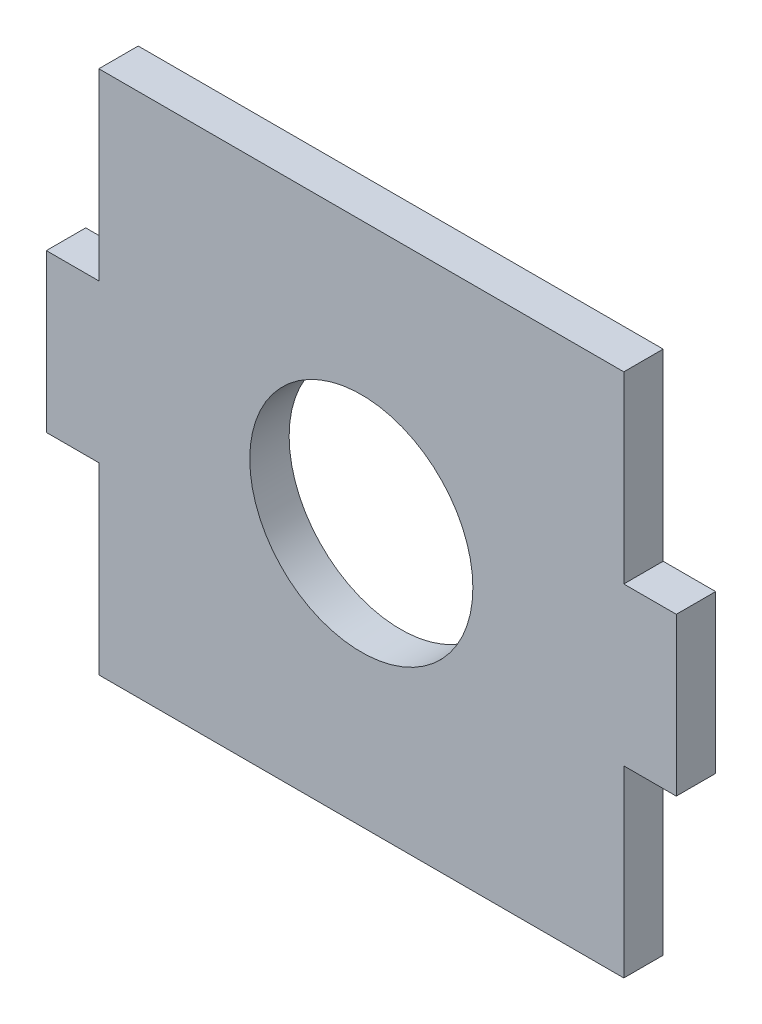
ISO-10303-21;
HEADER;
FILE_DESCRIPTION(('STEP AP214'),'2;1');
FILE_NAME('part.step','',(''),(''),'','','');
FILE_SCHEMA(('AUTOMOTIVE_DESIGN { 1 0 10303 214 1 1 1 1 }'));
ENDSEC;
DATA;
#1=APPLICATION_CONTEXT('core data for automotive mechanical design processes');
#2=APPLICATION_PROTOCOL_DEFINITION('international standard','automotive_design',2000,#1);
#3=PRODUCT_CONTEXT('',#1,'mechanical');
#4=PRODUCT('Part','Part','',(#3));
#5=PRODUCT_RELATED_PRODUCT_CATEGORY('part','',(#4));
#6=PRODUCT_DEFINITION_FORMATION('','',#4);
#7=PRODUCT_DEFINITION_CONTEXT('part definition',#1,'design');
#8=PRODUCT_DEFINITION('design','',#6,#7);
#9=PRODUCT_DEFINITION_SHAPE('','',#8);
#10=(LENGTH_UNIT() NAMED_UNIT(*) SI_UNIT(.MILLI.,.METRE.));
#11=(NAMED_UNIT(*) PLANE_ANGLE_UNIT() SI_UNIT($,.RADIAN.));
#12=(NAMED_UNIT(*) SI_UNIT($,.STERADIAN.) SOLID_ANGLE_UNIT());
#13=UNCERTAINTY_MEASURE_WITH_UNIT(LENGTH_MEASURE(1.E-05),#10,'distance_accuracy_value','');
#14=(GEOMETRIC_REPRESENTATION_CONTEXT(3) GLOBAL_UNCERTAINTY_ASSIGNED_CONTEXT((#13)) GLOBAL_UNIT_ASSIGNED_CONTEXT((#10,
#11,#12)) REPRESENTATION_CONTEXT('',''));
#15=CARTESIAN_POINT('',(0.,0.,0.));
#16=DIRECTION('',(0.,0.,1.));
#17=DIRECTION('',(1.,0.,0.));
#18=AXIS2_PLACEMENT_3D('',#15,#16,#17);
#19=CARTESIAN_POINT('',(0.,0.,4.7625));
#20=DIRECTION('',(0.,1.,0.));
#21=DIRECTION('',(0.,0.,1.));
#22=AXIS2_PLACEMENT_3D('',#19,#20,#21);
#23=PLANE('',#22);
#24=DIRECTION('',(1.,0.,0.));
#25=VECTOR('',#24,1.);
#26=CARTESIAN_POINT('',(0.,0.,0.));
#27=LINE('',#26,#25);
#28=CARTESIAN_POINT('',(0.,0.,0.));
#29=VERTEX_POINT('',#28);
#30=CARTESIAN_POINT('',(63.5,0.,0.));
#31=VERTEX_POINT('',#30);
#32=EDGE_CURVE('E164',#29,#31,#27,.T.);
#33=ORIENTED_EDGE('',*,*,#32,.T.);
#34=DIRECTION('',(0.,0.,-1.));
#35=VECTOR('',#34,1.);
#36=CARTESIAN_POINT('',(63.5,0.,4.7625));
#37=LINE('',#36,#35);
#38=CARTESIAN_POINT('',(63.5,0.,4.7625));
#39=VERTEX_POINT('',#38);
#40=EDGE_CURVE('E11',#39,#31,#37,.T.);
#41=ORIENTED_EDGE('',*,*,#40,.F.);
#42=DIRECTION('',(1.,0.,0.));
#43=VECTOR('',#42,1.);
#44=CARTESIAN_POINT('',(0.,0.,4.7625));
#45=LINE('',#44,#43);
#46=CARTESIAN_POINT('',(0.,0.,4.7625));
#47=VERTEX_POINT('',#46);
#48=EDGE_CURVE('E356',#47,#39,#45,.T.);
#49=ORIENTED_EDGE('',*,*,#48,.F.);
#50=DIRECTION('',(0.,0.,-1.));
#51=VECTOR('',#50,1.);
#52=CARTESIAN_POINT('',(0.,0.,4.7625));
#53=LINE('',#52,#51);
#54=EDGE_CURVE('E54',#47,#29,#53,.T.);
#55=ORIENTED_EDGE('',*,*,#54,.T.);
#56=EDGE_LOOP('',(#33,#41,#49,#55));
#57=FACE_BOUND('',#56,.T.);
#58=ADVANCED_FACE('F37',(#57),#23,.F.);
#59=CARTESIAN_POINT('',(63.5,0.,4.7625));
#60=DIRECTION('',(-1.,0.,0.));
#61=DIRECTION('',(0.,0.,1.));
#62=AXIS2_PLACEMENT_3D('',#59,#60,#61);
#63=PLANE('',#62);
#64=DIRECTION('',(0.,1.,0.));
#65=VECTOR('',#64,1.);
#66=CARTESIAN_POINT('',(63.5,0.,0.));
#67=LINE('',#66,#65);
#68=CARTESIAN_POINT('',(63.5,22.225,0.));
#69=VERTEX_POINT('',#68);
#70=EDGE_CURVE('E166',#31,#69,#67,.T.);
#71=ORIENTED_EDGE('',*,*,#70,.T.);
#72=DIRECTION('',(0.,0.,-1.));
#73=VECTOR('',#72,1.);
#74=CARTESIAN_POINT('',(63.5,22.225,4.7625));
#75=LINE('',#74,#73);
#76=CARTESIAN_POINT('',(63.5,22.225,4.7625));
#77=VERTEX_POINT('',#76);
#78=EDGE_CURVE('E46',#77,#69,#75,.T.);
#79=ORIENTED_EDGE('',*,*,#78,.F.);
#80=DIRECTION('',(0.,1.,0.));
#81=VECTOR('',#80,1.);
#82=CARTESIAN_POINT('',(63.5,0.,4.7625));
#83=LINE('',#82,#81);
#84=EDGE_CURVE('E104',#39,#77,#83,.T.);
#85=ORIENTED_EDGE('',*,*,#84,.F.);
#86=ORIENTED_EDGE('',*,*,#40,.T.);
#87=EDGE_LOOP('',(#71,#79,#85,#86));
#88=FACE_BOUND('',#87,.T.);
#89=ADVANCED_FACE('F257',(#88),#63,.F.);
#90=CARTESIAN_POINT('',(0.,22.225,4.7625));
#91=DIRECTION('',(0.,1.,0.));
#92=DIRECTION('',(0.,0.,1.));
#93=AXIS2_PLACEMENT_3D('',#90,#91,#92);
#94=PLANE('',#93);
#95=DIRECTION('',(1.,0.,0.));
#96=VECTOR('',#95,1.);
#97=CARTESIAN_POINT('',(0.,22.225,0.));
#98=LINE('',#97,#96);
#99=CARTESIAN_POINT('',(69.85,22.225,0.));
#100=VERTEX_POINT('',#99);
#101=EDGE_CURVE('E168',#69,#100,#98,.T.);
#102=ORIENTED_EDGE('',*,*,#101,.T.);
#103=DIRECTION('',(0.,0.,-1.));
#104=VECTOR('',#103,1.);
#105=CARTESIAN_POINT('',(69.85,22.225,4.7625));
#106=LINE('',#105,#104);
#107=CARTESIAN_POINT('',(69.85,22.225,4.7625));
#108=VERTEX_POINT('',#107);
#109=EDGE_CURVE('E203',#108,#100,#106,.T.);
#110=ORIENTED_EDGE('',*,*,#109,.F.);
#111=DIRECTION('',(1.,0.,0.));
#112=VECTOR('',#111,1.);
#113=CARTESIAN_POINT('',(0.,22.225,4.7625));
#114=LINE('',#113,#112);
#115=EDGE_CURVE('E210',#77,#108,#114,.T.);
#116=ORIENTED_EDGE('',*,*,#115,.F.);
#117=ORIENTED_EDGE('',*,*,#78,.T.);
#118=EDGE_LOOP('',(#102,#110,#116,#117));
#119=FACE_BOUND('',#118,.T.);
#120=ADVANCED_FACE('F208',(#119),#94,.F.);
#121=CARTESIAN_POINT('',(69.85,0.,4.7625));
#122=DIRECTION('',(1.,0.,0.));
#123=DIRECTION('',(0.,1.,0.));
#124=AXIS2_PLACEMENT_3D('',#121,#122,#123);
#125=PLANE('',#124);
#126=DIRECTION('',(0.,-1.,0.));
#127=VECTOR('',#126,1.);
#128=CARTESIAN_POINT('',(69.85,0.,0.));
#129=LINE('',#128,#127);
#130=CARTESIAN_POINT('',(69.85,41.275,0.));
#131=VERTEX_POINT('',#130);
#132=EDGE_CURVE('E172',#131,#100,#129,.T.);
#133=ORIENTED_EDGE('',*,*,#132,.F.);
#134=DIRECTION('',(0.,0.,-1.));
#135=VECTOR('',#134,1.);
#136=CARTESIAN_POINT('',(69.85,41.275,4.7625));
#137=LINE('',#136,#135);
#138=CARTESIAN_POINT('',(69.85,41.275,4.7625));
#139=VERTEX_POINT('',#138);
#140=EDGE_CURVE('E201',#139,#131,#137,.T.);
#141=ORIENTED_EDGE('',*,*,#140,.F.);
#142=DIRECTION('',(0.,-1.,0.));
#143=VECTOR('',#142,1.);
#144=CARTESIAN_POINT('',(69.85,0.,4.7625));
#145=LINE('',#144,#143);
#146=EDGE_CURVE('E220',#139,#108,#145,.T.);
#147=ORIENTED_EDGE('',*,*,#146,.T.);
#148=ORIENTED_EDGE('',*,*,#109,.T.);
#149=EDGE_LOOP('',(#133,#141,#147,#148));
#150=FACE_BOUND('',#149,.T.);
#151=ADVANCED_FACE('F217',(#150),#125,.T.);
#152=CARTESIAN_POINT('',(0.,41.275,4.7625));
#153=DIRECTION('',(0.,1.,0.));
#154=DIRECTION('',(0.,0.,1.));
#155=AXIS2_PLACEMENT_3D('',#152,#153,#154);
#156=PLANE('',#155);
#157=DIRECTION('',(1.,0.,0.));
#158=VECTOR('',#157,1.);
#159=CARTESIAN_POINT('',(0.,41.275,0.));
#160=LINE('',#159,#158);
#161=CARTESIAN_POINT('',(63.5,41.275,0.));
#162=VERTEX_POINT('',#161);
#163=EDGE_CURVE('E175',#162,#131,#160,.T.);
#164=ORIENTED_EDGE('',*,*,#163,.F.);
#165=DIRECTION('',(0.,0.,-1.));
#166=VECTOR('',#165,1.);
#167=CARTESIAN_POINT('',(63.5,41.275,4.7625));
#168=LINE('',#167,#166);
#169=CARTESIAN_POINT('',(63.5,41.275,4.7625));
#170=VERTEX_POINT('',#169);
#171=EDGE_CURVE('E199',#170,#162,#168,.T.);
#172=ORIENTED_EDGE('',*,*,#171,.F.);
#173=DIRECTION('',(1.,0.,0.));
#174=VECTOR('',#173,1.);
#175=CARTESIAN_POINT('',(0.,41.275,4.7625));
#176=LINE('',#175,#174);
#177=EDGE_CURVE('E223',#170,#139,#176,.T.);
#178=ORIENTED_EDGE('',*,*,#177,.T.);
#179=ORIENTED_EDGE('',*,*,#140,.T.);
#180=EDGE_LOOP('',(#164,#172,#178,#179));
#181=FACE_BOUND('',#180,.T.);
#182=ADVANCED_FACE('F268',(#181),#156,.T.);
#183=CARTESIAN_POINT('',(63.5,63.5,0.));
#184=VERTEX_POINT('',#183);
#185=EDGE_CURVE('E169',#162,#184,#67,.T.);
#186=ORIENTED_EDGE('',*,*,#185,.T.);
#187=DIRECTION('',(0.,0.,-1.));
#188=VECTOR('',#187,1.);
#189=CARTESIAN_POINT('',(63.5,63.5,4.7625));
#190=LINE('',#189,#188);
#191=CARTESIAN_POINT('',(63.5,63.5,4.7625));
#192=VERTEX_POINT('',#191);
#193=EDGE_CURVE('E197',#192,#184,#190,.T.);
#194=ORIENTED_EDGE('',*,*,#193,.F.);
#195=EDGE_CURVE('E225',#170,#192,#83,.T.);
#196=ORIENTED_EDGE('',*,*,#195,.F.);
#197=ORIENTED_EDGE('',*,*,#171,.T.);
#198=EDGE_LOOP('',(#186,#194,#196,#197));
#199=FACE_BOUND('',#198,.T.);
#200=ADVANCED_FACE('F262',(#199),#63,.F.);
#201=CARTESIAN_POINT('',(0.,63.5,4.7625));
#202=DIRECTION('',(0.,1.,0.));
#203=DIRECTION('',(0.,0.,1.));
#204=AXIS2_PLACEMENT_3D('',#201,#202,#203);
#205=PLANE('',#204);
#206=DIRECTION('',(1.,0.,0.));
#207=VECTOR('',#206,1.);
#208=CARTESIAN_POINT('',(0.,63.5,0.));
#209=LINE('',#208,#207);
#210=CARTESIAN_POINT('',(0.,63.5,0.));
#211=VERTEX_POINT('',#210);
#212=EDGE_CURVE('E178',#211,#184,#209,.T.);
#213=ORIENTED_EDGE('',*,*,#212,.F.);
#214=DIRECTION('',(0.,0.,-1.));
#215=VECTOR('',#214,1.);
#216=CARTESIAN_POINT('',(0.,63.5,4.7625));
#217=LINE('',#216,#215);
#218=CARTESIAN_POINT('',(0.,63.5,4.7625));
#219=VERTEX_POINT('',#218);
#220=EDGE_CURVE('E195',#219,#211,#217,.T.);
#221=ORIENTED_EDGE('',*,*,#220,.F.);
#222=DIRECTION('',(1.,0.,0.));
#223=VECTOR('',#222,1.);
#224=CARTESIAN_POINT('',(0.,63.5,4.7625));
#225=LINE('',#224,#223);
#226=EDGE_CURVE('E230',#219,#192,#225,.T.);
#227=ORIENTED_EDGE('',*,*,#226,.T.);
#228=ORIENTED_EDGE('',*,*,#193,.T.);
#229=EDGE_LOOP('',(#213,#221,#227,#228));
#230=FACE_BOUND('',#229,.T.);
#231=ADVANCED_FACE('F241',(#230),#205,.T.);
#232=CARTESIAN_POINT('',(0.,0.,4.7625));
#233=DIRECTION('',(-1.,0.,0.));
#234=DIRECTION('',(0.,0.,1.));
#235=AXIS2_PLACEMENT_3D('',#232,#233,#234);
#236=PLANE('',#235);
#237=DIRECTION('',(0.,1.,0.));
#238=VECTOR('',#237,1.);
#239=CARTESIAN_POINT('',(0.,0.,0.));
#240=LINE('',#239,#238);
#241=CARTESIAN_POINT('',(0.,41.275,0.));
#242=VERTEX_POINT('',#241);
#243=EDGE_CURVE('E181',#242,#211,#240,.T.);
#244=ORIENTED_EDGE('',*,*,#243,.F.);
#245=DIRECTION('',(0.,0.,-1.));
#246=VECTOR('',#245,1.);
#247=CARTESIAN_POINT('',(0.,41.275,4.7625));
#248=LINE('',#247,#246);
#249=CARTESIAN_POINT('',(0.,41.275,4.7625));
#250=VERTEX_POINT('',#249);
#251=EDGE_CURVE('E193',#250,#242,#248,.T.);
#252=ORIENTED_EDGE('',*,*,#251,.F.);
#253=DIRECTION('',(0.,1.,0.));
#254=VECTOR('',#253,1.);
#255=CARTESIAN_POINT('',(0.,0.,4.7625));
#256=LINE('',#255,#254);
#257=EDGE_CURVE('E158',#250,#219,#256,.T.);
#258=ORIENTED_EDGE('',*,*,#257,.T.);
#259=ORIENTED_EDGE('',*,*,#220,.T.);
#260=EDGE_LOOP('',(#244,#252,#258,#259));
#261=FACE_BOUND('',#260,.T.);
#262=ADVANCED_FACE('F235',(#261),#236,.T.);
#263=CARTESIAN_POINT('',(0.,41.275,4.7625));
#264=DIRECTION('',(0.,-1.,0.));
#265=DIRECTION('',(0.,0.,-1.));
#266=AXIS2_PLACEMENT_3D('',#263,#264,#265);
#267=PLANE('',#266);
#268=DIRECTION('',(-1.,0.,0.));
#269=VECTOR('',#268,1.);
#270=CARTESIAN_POINT('',(0.,41.275,0.));
#271=LINE('',#270,#269);
#272=CARTESIAN_POINT('',(-6.35,41.275,0.));
#273=VERTEX_POINT('',#272);
#274=EDGE_CURVE('E184',#242,#273,#271,.T.);
#275=ORIENTED_EDGE('',*,*,#274,.T.);
#276=DIRECTION('',(0.,0.,-1.));
#277=VECTOR('',#276,1.);
#278=CARTESIAN_POINT('',(-6.35,41.275,4.7625));
#279=LINE('',#278,#277);
#280=CARTESIAN_POINT('',(-6.35,41.275,4.7625));
#281=VERTEX_POINT('',#280);
#282=EDGE_CURVE('E152',#281,#273,#279,.T.);
#283=ORIENTED_EDGE('',*,*,#282,.F.);
#284=DIRECTION('',(-1.,0.,0.));
#285=VECTOR('',#284,1.);
#286=CARTESIAN_POINT('',(0.,41.275,4.7625));
#287=LINE('',#286,#285);
#288=EDGE_CURVE('E140',#250,#281,#287,.T.);
#289=ORIENTED_EDGE('',*,*,#288,.F.);
#290=ORIENTED_EDGE('',*,*,#251,.T.);
#291=EDGE_LOOP('',(#275,#283,#289,#290));
#292=FACE_BOUND('',#291,.T.);
#293=ADVANCED_FACE('F245',(#292),#267,.F.);
#294=CARTESIAN_POINT('',(-6.34999999999999,0.,4.7625));
#295=DIRECTION('',(1.,0.,0.));
#296=DIRECTION('',(0.,1.,0.));
#297=AXIS2_PLACEMENT_3D('',#294,#295,#296);
#298=PLANE('',#297);
#299=DIRECTION('',(0.,-1.,0.));
#300=VECTOR('',#299,1.);
#301=CARTESIAN_POINT('',(-6.34999999999999,0.,0.));
#302=LINE('',#301,#300);
#303=CARTESIAN_POINT('',(-6.35,22.225,0.));
#304=VERTEX_POINT('',#303);
#305=EDGE_CURVE('E149',#273,#304,#302,.T.);
#306=ORIENTED_EDGE('',*,*,#305,.T.);
#307=DIRECTION('',(0.,0.,-1.));
#308=VECTOR('',#307,1.);
#309=CARTESIAN_POINT('',(-6.35,22.225,4.7625));
#310=LINE('',#309,#308);
#311=CARTESIAN_POINT('',(-6.35,22.225,4.7625));
#312=VERTEX_POINT('',#311);
#313=EDGE_CURVE('E146',#312,#304,#310,.T.);
#314=ORIENTED_EDGE('',*,*,#313,.F.);
#315=DIRECTION('',(0.,-1.,0.));
#316=VECTOR('',#315,1.);
#317=CARTESIAN_POINT('',(-6.34999999999999,0.,4.7625));
#318=LINE('',#317,#316);
#319=EDGE_CURVE('E132',#281,#312,#318,.T.);
#320=ORIENTED_EDGE('',*,*,#319,.F.);
#321=ORIENTED_EDGE('',*,*,#282,.T.);
#322=EDGE_LOOP('',(#306,#314,#320,#321));
#323=FACE_BOUND('',#322,.T.);
#324=ADVANCED_FACE('F147',(#323),#298,.F.);
#325=CARTESIAN_POINT('',(0.,22.225,4.7625));
#326=DIRECTION('',(0.,-1.,0.));
#327=DIRECTION('',(1.,0.,0.));
#328=AXIS2_PLACEMENT_3D('',#325,#326,#327);
#329=PLANE('',#328);
#330=DIRECTION('',(-1.,0.,0.));
#331=VECTOR('',#330,1.);
#332=CARTESIAN_POINT('',(0.,22.225,0.));
#333=LINE('',#332,#331);
#334=CARTESIAN_POINT('',(0.,22.225,0.));
#335=VERTEX_POINT('',#334);
#336=EDGE_CURVE('E188',#335,#304,#333,.T.);
#337=ORIENTED_EDGE('',*,*,#336,.F.);
#338=DIRECTION('',(0.,0.,-1.));
#339=VECTOR('',#338,1.);
#340=CARTESIAN_POINT('',(0.,22.225,4.7625));
#341=LINE('',#340,#339);
#342=CARTESIAN_POINT('',(0.,22.225,4.7625));
#343=VERTEX_POINT('',#342);
#344=EDGE_CURVE('E92',#343,#335,#341,.T.);
#345=ORIENTED_EDGE('',*,*,#344,.F.);
#346=DIRECTION('',(-1.,0.,0.));
#347=VECTOR('',#346,1.);
#348=CARTESIAN_POINT('',(0.,22.225,4.7625));
#349=LINE('',#348,#347);
#350=EDGE_CURVE('E137',#343,#312,#349,.T.);
#351=ORIENTED_EDGE('',*,*,#350,.T.);
#352=ORIENTED_EDGE('',*,*,#313,.T.);
#353=EDGE_LOOP('',(#337,#345,#351,#352));
#354=FACE_BOUND('',#353,.T.);
#355=ADVANCED_FACE('F154',(#354),#329,.T.);
#356=CARTESIAN_POINT('',(31.75,31.75,4.7625));
#357=DIRECTION('',(0.,0.,-1.));
#358=DIRECTION('',(-1.,0.,0.));
#359=AXIS2_PLACEMENT_3D('',#356,#357,#358);
#360=CYLINDRICAL_SURFACE('',#359,13.49375);
#361=CARTESIAN_POINT('',(31.75,31.75,4.7625));
#362=DIRECTION('',(0.,0.,1.));
#363=DIRECTION('',(1.,0.,0.));
#364=AXIS2_PLACEMENT_3D('',#361,#362,#363);
#365=CIRCLE('',#364,13.49375);
#366=CARTESIAN_POINT('',(45.24375,31.75,4.7625));
#367=VERTEX_POINT('',#366);
#368=EDGE_CURVE('E355',#367,#367,#365,.T.);
#369=ORIENTED_EDGE('',*,*,#368,.T.);
#370=EDGE_LOOP('',(#369));
#371=FACE_BOUND('',#370,.T.);
#372=CARTESIAN_POINT('',(31.75,31.75,0.));
#373=DIRECTION('',(0.,0.,1.));
#374=DIRECTION('',(1.,0.,0.));
#375=AXIS2_PLACEMENT_3D('',#372,#373,#374);
#376=CIRCLE('',#375,13.49375);
#377=CARTESIAN_POINT('',(45.24375,31.75,0.));
#378=VERTEX_POINT('',#377);
#379=EDGE_CURVE('E161',#378,#378,#376,.T.);
#380=ORIENTED_EDGE('',*,*,#379,.F.);
#381=EDGE_LOOP('',(#380));
#382=FACE_BOUND('',#381,.T.);
#383=ADVANCED_FACE('F39',(#371,#382),#360,.F.);
#384=EDGE_CURVE('E185',#29,#335,#240,.T.);
#385=ORIENTED_EDGE('',*,*,#384,.F.);
#386=ORIENTED_EDGE('',*,*,#54,.F.);
#387=EDGE_CURVE('E155',#47,#343,#256,.T.);
#388=ORIENTED_EDGE('',*,*,#387,.T.);
#389=ORIENTED_EDGE('',*,*,#344,.T.);
#390=EDGE_LOOP('',(#385,#386,#388,#389));
#391=FACE_BOUND('',#390,.T.);
#392=ADVANCED_FACE('F254',(#391),#236,.T.);
#393=CARTESIAN_POINT('',(0.,0.,4.7625));
#394=DIRECTION('',(0.,0.,1.));
#395=DIRECTION('',(1.,0.,0.));
#396=AXIS2_PLACEMENT_3D('',#393,#394,#395);
#397=PLANE('',#396);
#398=ORIENTED_EDGE('',*,*,#368,.F.);
#399=EDGE_LOOP('',(#398));
#400=FACE_BOUND('',#399,.T.);
#401=ORIENTED_EDGE('',*,*,#48,.T.);
#402=ORIENTED_EDGE('',*,*,#84,.T.);
#403=ORIENTED_EDGE('',*,*,#115,.T.);
#404=ORIENTED_EDGE('',*,*,#146,.F.);
#405=ORIENTED_EDGE('',*,*,#177,.F.);
#406=ORIENTED_EDGE('',*,*,#195,.T.);
#407=ORIENTED_EDGE('',*,*,#226,.F.);
#408=ORIENTED_EDGE('',*,*,#257,.F.);
#409=ORIENTED_EDGE('',*,*,#288,.T.);
#410=ORIENTED_EDGE('',*,*,#319,.T.);
#411=ORIENTED_EDGE('',*,*,#350,.F.);
#412=ORIENTED_EDGE('',*,*,#387,.F.);
#413=EDGE_LOOP('',(#401,#402,#403,#404,#405,#406,#407,#408,#409,#410,#411,#412));
#414=FACE_BOUND('',#413,.T.);
#415=ADVANCED_FACE('F134',(#400,#414),#397,.T.);
#416=CARTESIAN_POINT('',(0.,0.,0.));
#417=DIRECTION('',(0.,0.,1.));
#418=DIRECTION('',(1.,0.,0.));
#419=AXIS2_PLACEMENT_3D('',#416,#417,#418);
#420=PLANE('',#419);
#421=ORIENTED_EDGE('',*,*,#379,.T.);
#422=EDGE_LOOP('',(#421));
#423=FACE_BOUND('',#422,.T.);
#424=ORIENTED_EDGE('',*,*,#32,.F.);
#425=ORIENTED_EDGE('',*,*,#384,.T.);
#426=ORIENTED_EDGE('',*,*,#336,.T.);
#427=ORIENTED_EDGE('',*,*,#305,.F.);
#428=ORIENTED_EDGE('',*,*,#274,.F.);
#429=ORIENTED_EDGE('',*,*,#243,.T.);
#430=ORIENTED_EDGE('',*,*,#212,.T.);
#431=ORIENTED_EDGE('',*,*,#185,.F.);
#432=ORIENTED_EDGE('',*,*,#163,.T.);
#433=ORIENTED_EDGE('',*,*,#132,.T.);
#434=ORIENTED_EDGE('',*,*,#101,.F.);
#435=ORIENTED_EDGE('',*,*,#70,.F.);
#436=EDGE_LOOP('',(#424,#425,#426,#427,#428,#429,#430,#431,#432,#433,#434,#435));
#437=FACE_BOUND('',#436,.T.);
#438=ADVANCED_FACE('F212',(#423,#437),#420,.F.);
#439=CLOSED_SHELL('',(#58,#89,#120,#151,#182,#200,#231,#262,#293,#324,#355,#383,#392,#415,#438));
#440=MANIFOLD_SOLID_BREP('B2',#439);
#441=ADVANCED_BREP_SHAPE_REPRESENTATION('',(#18,#440),#14);
#442=SHAPE_DEFINITION_REPRESENTATION(#9,#441);
ENDSEC;
END-ISO-10303-21;
